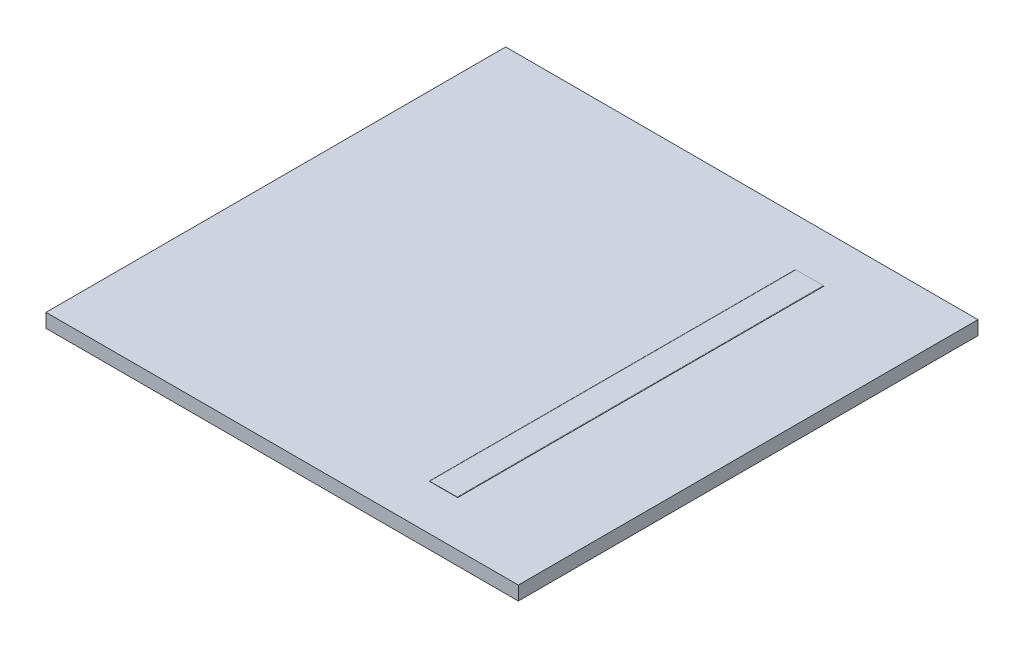
ISO-10303-21;
HEADER;
FILE_DESCRIPTION(('STEP AP214'),'2;1');
FILE_NAME('part.step','',(''),(''),'','','');
FILE_SCHEMA(('AUTOMOTIVE_DESIGN { 1 0 10303 214 1 1 1 1 }'));
ENDSEC;
DATA;
#1=APPLICATION_CONTEXT('core data for automotive mechanical design processes');
#2=APPLICATION_PROTOCOL_DEFINITION('international standard','automotive_design',2000,#1);
#3=PRODUCT_CONTEXT('',#1,'mechanical');
#4=PRODUCT('Part','Part','',(#3));
#5=PRODUCT_RELATED_PRODUCT_CATEGORY('part','',(#4));
#6=PRODUCT_DEFINITION_FORMATION('','',#4);
#7=PRODUCT_DEFINITION_CONTEXT('part definition',#1,'design');
#8=PRODUCT_DEFINITION('design','',#6,#7);
#9=PRODUCT_DEFINITION_SHAPE('','',#8);
#10=(LENGTH_UNIT() NAMED_UNIT(*) SI_UNIT(.MILLI.,.METRE.));
#11=(NAMED_UNIT(*) PLANE_ANGLE_UNIT() SI_UNIT($,.RADIAN.));
#12=(NAMED_UNIT(*) SI_UNIT($,.STERADIAN.) SOLID_ANGLE_UNIT());
#13=UNCERTAINTY_MEASURE_WITH_UNIT(LENGTH_MEASURE(1.E-05),#10,'distance_accuracy_value','');
#14=(GEOMETRIC_REPRESENTATION_CONTEXT(3) GLOBAL_UNCERTAINTY_ASSIGNED_CONTEXT((#13)) GLOBAL_UNIT_ASSIGNED_CONTEXT((#10,
#11,#12)) REPRESENTATION_CONTEXT('',''));
#15=CARTESIAN_POINT('',(0.,0.,0.));
#16=DIRECTION('',(0.,0.,1.));
#17=DIRECTION('',(1.,0.,0.));
#18=AXIS2_PLACEMENT_3D('',#15,#16,#17);
#19=CARTESIAN_POINT('',(85.5328522231227,11.1616821380238,300.));
#20=DIRECTION('',(0.,1.,0.));
#21=DIRECTION('',(-1.,0.,0.));
#22=AXIS2_PLACEMENT_3D('',#19,#20,#21);
#23=PLANE('',#22);
#24=DIRECTION('',(-1.,0.,0.));
#25=VECTOR('',#24,1.);
#26=CARTESIAN_POINT('',(108.54407460005,11.1616821380238,300.));
#27=LINE('',#26,#25);
#28=CARTESIAN_POINT('',(108.37848819904,11.1616821380238,300.));
#29=VERTEX_POINT('',#28);
#30=CARTESIAN_POINT('',(107.849337936827,11.1616821380238,300.));
#31=VERTEX_POINT('',#30);
#32=EDGE_CURVE('E62',#29,#31,#27,.T.);
#33=ORIENTED_EDGE('',*,*,#32,.T.);
#34=DIRECTION('',(1.,0.,0.));
#35=VECTOR('',#34,1.);
#36=CARTESIAN_POINT('',(85.5328522231227,11.1616821380238,300.));
#37=LINE('',#36,#35);
#38=CARTESIAN_POINT('',(85.5328522231227,11.1616821380238,300.));
#39=VERTEX_POINT('',#38);
#40=EDGE_CURVE('E175',#39,#31,#37,.T.);
#41=ORIENTED_EDGE('',*,*,#40,.F.);
#42=DIRECTION('',(-1.,0.,0.));
#43=VECTOR('',#42,1.);
#44=CARTESIAN_POINT('',(85.5328522231227,11.1616821380238,300.));
#45=LINE('',#44,#43);
#46=CARTESIAN_POINT('',(85.0037019609098,11.1616821380238,300.));
#47=VERTEX_POINT('',#46);
#48=EDGE_CURVE('E163',#39,#47,#45,.T.);
#49=ORIENTED_EDGE('',*,*,#48,.T.);
#50=DIRECTION('',(0.,0.,-1.));
#51=VECTOR('',#50,1.);
#52=CARTESIAN_POINT('',(85.0037019609098,11.1616821380238,300.));
#53=LINE('',#52,#51);
#54=CARTESIAN_POINT('',(85.0037019609098,11.1616821380238,0.));
#55=VERTEX_POINT('',#54);
#56=EDGE_CURVE('E154',#47,#55,#53,.T.);
#57=ORIENTED_EDGE('',*,*,#56,.T.);
#58=DIRECTION('',(1.,0.,0.));
#59=VECTOR('',#58,1.);
#60=CARTESIAN_POINT('',(84.8279240086719,11.1616821380238,0.));
#61=LINE('',#60,#59);
#62=CARTESIAN_POINT('',(85.5328522231227,11.1616821380238,0.));
#63=VERTEX_POINT('',#62);
#64=EDGE_CURVE('E151',#55,#63,#61,.T.);
#65=ORIENTED_EDGE('',*,*,#64,.T.);
#66=DIRECTION('',(1.,0.,0.));
#67=VECTOR('',#66,1.);
#68=CARTESIAN_POINT('',(85.5328522231227,11.1616821380238,0.));
#69=LINE('',#68,#67);
#70=CARTESIAN_POINT('',(107.849337936827,11.1616821380238,0.));
#71=VERTEX_POINT('',#70);
#72=EDGE_CURVE('E170',#63,#71,#69,.T.);
#73=ORIENTED_EDGE('',*,*,#72,.T.);
#74=DIRECTION('',(1.,0.,0.));
#75=VECTOR('',#74,1.);
#76=CARTESIAN_POINT('',(107.849337936827,11.1616821380238,0.));
#77=LINE('',#76,#75);
#78=CARTESIAN_POINT('',(108.37848819904,11.1616821380238,0.));
#79=VERTEX_POINT('',#78);
#80=EDGE_CURVE('E160',#71,#79,#77,.T.);
#81=ORIENTED_EDGE('',*,*,#80,.T.);
#82=DIRECTION('',(0.,0.,-1.));
#83=VECTOR('',#82,1.);
#84=CARTESIAN_POINT('',(108.37848819904,11.1616821380238,300.));
#85=LINE('',#84,#83);
#86=EDGE_CURVE('E157',#79,#29,#85,.F.);
#87=ORIENTED_EDGE('',*,*,#86,.T.);
#88=EDGE_LOOP('',(#33,#41,#49,#57,#65,#73,#81,#87));
#89=FACE_BOUND('',#88,.T.);
#90=DIRECTION('',(0.,0.,1.));
#91=VECTOR('',#90,1.);
#92=CARTESIAN_POINT('',(195.240578093479,11.1616821380238,-39.3837362637363));
#93=LINE('',#92,#91);
#94=CARTESIAN_POINT('',(195.240578093479,11.1616821380238,-39.3837362637363));
#95=VERTEX_POINT('',#94);
#96=CARTESIAN_POINT('',(195.240578093479,11.1616821380238,337.155692307692));
#97=VERTEX_POINT('',#96);
#98=EDGE_CURVE('E149',#95,#97,#93,.T.);
#99=ORIENTED_EDGE('',*,*,#98,.F.);
#100=DIRECTION('',(1.,0.,0.));
#101=VECTOR('',#100,1.);
#102=CARTESIAN_POINT('',(195.240578093479,11.1616821380238,-39.3837362637363));
#103=LINE('',#102,#101);
#104=CARTESIAN_POINT('',(-191.696388939488,11.1616821380238,-39.3837362637363));
#105=VERTEX_POINT('',#104);
#106=EDGE_CURVE('E138',#105,#95,#103,.T.);
#107=ORIENTED_EDGE('',*,*,#106,.F.);
#108=DIRECTION('',(0.,0.,-1.));
#109=VECTOR('',#108,1.);
#110=CARTESIAN_POINT('',(-191.696388939488,11.1616821380238,-39.3837362637363));
#111=LINE('',#110,#109);
#112=CARTESIAN_POINT('',(-191.696388939488,11.1616821380238,337.155692307692));
#113=VERTEX_POINT('',#112);
#114=EDGE_CURVE('E137',#113,#105,#111,.T.);
#115=ORIENTED_EDGE('',*,*,#114,.F.);
#116=DIRECTION('',(-1.,0.,0.));
#117=VECTOR('',#116,1.);
#118=CARTESIAN_POINT('',(195.240578093479,11.1616821380238,337.155692307692));
#119=LINE('',#118,#117);
#120=EDGE_CURVE('E123',#97,#113,#119,.T.);
#121=ORIENTED_EDGE('',*,*,#120,.F.);
#122=EDGE_LOOP('',(#99,#107,#115,#121));
#123=FACE_BOUND('',#122,.T.);
#124=ADVANCED_FACE('F39',(#89,#123),#23,.T.);
#125=CARTESIAN_POINT('',(195.240578093479,551.071079838758,337.155692307692));
#126=DIRECTION('',(0.,0.,1.));
#127=DIRECTION('',(1.,0.,0.));
#128=AXIS2_PLACEMENT_3D('',#125,#126,#127);
#129=PLANE('',#128);
#130=DIRECTION('',(-1.,0.,0.));
#131=VECTOR('',#130,1.);
#132=CARTESIAN_POINT('',(-191.696388939488,-0.2,337.155692307692));
#133=LINE('',#132,#131);
#134=CARTESIAN_POINT('',(195.240578093479,-0.199999999999999,337.155692307692));
#135=VERTEX_POINT('',#134);
#136=CARTESIAN_POINT('',(-191.696388939488,-0.2,337.155692307692));
#137=VERTEX_POINT('',#136);
#138=EDGE_CURVE('E118',#135,#137,#133,.T.);
#139=ORIENTED_EDGE('',*,*,#138,.F.);
#140=DIRECTION('',(0.,-1.,0.));
#141=VECTOR('',#140,1.);
#142=CARTESIAN_POINT('',(195.240578093479,551.071079838758,337.155692307692));
#143=LINE('',#142,#141);
#144=EDGE_CURVE('E146',#97,#135,#143,.T.);
#145=ORIENTED_EDGE('',*,*,#144,.F.);
#146=ORIENTED_EDGE('',*,*,#120,.T.);
#147=DIRECTION('',(0.,-1.,0.));
#148=VECTOR('',#147,1.);
#149=CARTESIAN_POINT('',(-191.696388939488,551.071079838758,337.155692307692));
#150=LINE('',#149,#148);
#151=EDGE_CURVE('E141',#113,#137,#150,.T.);
#152=ORIENTED_EDGE('',*,*,#151,.T.);
#153=EDGE_LOOP('',(#139,#145,#146,#152));
#154=FACE_BOUND('',#153,.T.);
#155=ADVANCED_FACE('F232',(#154),#129,.T.);
#156=CARTESIAN_POINT('',(-191.696388939488,551.071079838758,-39.3837362637363));
#157=DIRECTION('',(-1.,0.,0.));
#158=DIRECTION('',(0.,0.,1.));
#159=AXIS2_PLACEMENT_3D('',#156,#157,#158);
#160=PLANE('',#159);
#161=DIRECTION('',(0.,0.,1.));
#162=VECTOR('',#161,1.);
#163=CARTESIAN_POINT('',(-191.696388939488,-0.2,-39.3837362637363));
#164=LINE('',#163,#162);
#165=CARTESIAN_POINT('',(-191.696388939488,-0.2,-39.3837362637363));
#166=VERTEX_POINT('',#165);
#167=EDGE_CURVE('E115',#166,#137,#164,.T.);
#168=ORIENTED_EDGE('',*,*,#167,.T.);
#169=ORIENTED_EDGE('',*,*,#151,.F.);
#170=ORIENTED_EDGE('',*,*,#114,.T.);
#171=DIRECTION('',(0.,-1.,0.));
#172=VECTOR('',#171,1.);
#173=CARTESIAN_POINT('',(-191.696388939488,551.071079838758,-39.3837362637363));
#174=LINE('',#173,#172);
#175=EDGE_CURVE('E131',#105,#166,#174,.T.);
#176=ORIENTED_EDGE('',*,*,#175,.T.);
#177=EDGE_LOOP('',(#168,#169,#170,#176));
#178=FACE_BOUND('',#177,.T.);
#179=ADVANCED_FACE('F136',(#178),#160,.T.);
#180=CARTESIAN_POINT('',(195.240578093479,551.071079838758,-39.3837362637363));
#181=DIRECTION('',(0.,0.,-1.));
#182=DIRECTION('',(-1.,0.,0.));
#183=AXIS2_PLACEMENT_3D('',#180,#181,#182);
#184=PLANE('',#183);
#185=DIRECTION('',(-1.,0.,0.));
#186=VECTOR('',#185,1.);
#187=CARTESIAN_POINT('',(-191.696388939488,-0.2,-39.3837362637363));
#188=LINE('',#187,#186);
#189=CARTESIAN_POINT('',(195.240578093479,-0.199999999999978,-39.3837362637363));
#190=VERTEX_POINT('',#189);
#191=EDGE_CURVE('E54',#190,#166,#188,.T.);
#192=ORIENTED_EDGE('',*,*,#191,.T.);
#193=ORIENTED_EDGE('',*,*,#175,.F.);
#194=ORIENTED_EDGE('',*,*,#106,.T.);
#195=DIRECTION('',(0.,-1.,0.));
#196=VECTOR('',#195,1.);
#197=CARTESIAN_POINT('',(195.240578093479,551.071079838758,-39.3837362637363));
#198=LINE('',#197,#196);
#199=EDGE_CURVE('E134',#95,#190,#198,.T.);
#200=ORIENTED_EDGE('',*,*,#199,.T.);
#201=EDGE_LOOP('',(#192,#193,#194,#200));
#202=FACE_BOUND('',#201,.T.);
#203=ADVANCED_FACE('F129',(#202),#184,.T.);
#204=CARTESIAN_POINT('',(195.240578093479,551.071079838758,-39.3837362637363));
#205=DIRECTION('',(1.,0.,0.));
#206=DIRECTION('',(0.,0.,-1.));
#207=AXIS2_PLACEMENT_3D('',#204,#205,#206);
#208=PLANE('',#207);
#209=DIRECTION('',(0.,0.,1.));
#210=VECTOR('',#209,1.);
#211=CARTESIAN_POINT('',(195.240578093479,-0.199999999999999,-39.3837362637363));
#212=LINE('',#211,#210);
#213=EDGE_CURVE('E124',#190,#135,#212,.T.);
#214=ORIENTED_EDGE('',*,*,#213,.F.);
#215=ORIENTED_EDGE('',*,*,#199,.F.);
#216=ORIENTED_EDGE('',*,*,#98,.T.);
#217=ORIENTED_EDGE('',*,*,#144,.T.);
#218=EDGE_LOOP('',(#214,#215,#216,#217));
#219=FACE_BOUND('',#218,.T.);
#220=ADVANCED_FACE('F287',(#219),#208,.T.);
#221=CARTESIAN_POINT('',(85.5328522231227,11.3616821380238,300.));
#222=DIRECTION('',(0.,0.,1.));
#223=DIRECTION('',(1.,0.,0.));
#224=AXIS2_PLACEMENT_3D('',#221,#222,#223);
#225=PLANE('',#224);
#226=ORIENTED_EDGE('',*,*,#48,.F.);
#227=DIRECTION('',(0.,-1.,0.));
#228=VECTOR('',#227,1.);
#229=CARTESIAN_POINT('',(85.5328522231227,11.3616821380238,300.));
#230=LINE('',#229,#228);
#231=CARTESIAN_POINT('',(85.5328522231227,11.3616821380238,300.));
#232=VERTEX_POINT('',#231);
#233=EDGE_CURVE('E11',#232,#39,#230,.T.);
#234=ORIENTED_EDGE('',*,*,#233,.F.);
#235=CARTESIAN_POINT('',(85.5328522231227,10.5616821380238,300.));
#236=DIRECTION('',(0.,0.,-1.));
#237=DIRECTION('',(-1.,0.,0.));
#238=AXIS2_PLACEMENT_3D('',#235,#236,#237);
#239=CIRCLE('',#238,0.800000000000009);
#240=EDGE_CURVE('E173',#47,#232,#239,.T.);
#241=ORIENTED_EDGE('',*,*,#240,.F.);
#242=EDGE_LOOP('',(#226,#234,#241));
#243=FACE_BOUND('',#242,.T.);
#244=ADVANCED_FACE('F41',(#243),#225,.T.);
#245=CARTESIAN_POINT('',(85.0041560622846,10.8453727609126,300.));
#246=DIRECTION('',(0.,0.,1.));
#247=DIRECTION('',(1.,0.,0.));
#248=AXIS2_PLACEMENT_3D('',#245,#246,#247);
#249=PLANE('',#248);
#250=DIRECTION('',(1.,0.,0.));
#251=VECTOR('',#250,1.);
#252=CARTESIAN_POINT('',(85.5328522231227,11.3616821380238,300.));
#253=LINE('',#252,#251);
#254=CARTESIAN_POINT('',(107.849337936827,11.3616821380238,300.));
#255=VERTEX_POINT('',#254);
#256=EDGE_CURVE('E169',#232,#255,#253,.T.);
#257=ORIENTED_EDGE('',*,*,#256,.F.);
#258=ORIENTED_EDGE('',*,*,#233,.T.);
#259=ORIENTED_EDGE('',*,*,#40,.T.);
#260=DIRECTION('',(0.,1.,0.));
#261=VECTOR('',#260,1.);
#262=CARTESIAN_POINT('',(107.849337936827,11.1616821380238,300.));
#263=LINE('',#262,#261);
#264=EDGE_CURVE('E196',#31,#255,#263,.T.);
#265=ORIENTED_EDGE('',*,*,#264,.T.);
#266=EDGE_LOOP('',(#257,#258,#259,#265));
#267=FACE_BOUND('',#266,.T.);
#268=ADVANCED_FACE('F223',(#267),#249,.T.);
#269=CARTESIAN_POINT('',(84.8279240086719,10.9399363018755,0.));
#270=DIRECTION('',(0.,0.,-1.));
#271=DIRECTION('',(-1.,0.,0.));
#272=AXIS2_PLACEMENT_3D('',#269,#270,#271);
#273=PLANE('',#272);
#274=ORIENTED_EDGE('',*,*,#64,.F.);
#275=CARTESIAN_POINT('',(85.5328522231227,10.5616821380238,0.));
#276=DIRECTION('',(0.,0.,-1.));
#277=DIRECTION('',(-1.,0.,0.));
#278=AXIS2_PLACEMENT_3D('',#275,#276,#277);
#279=CIRCLE('',#278,0.800000000000009);
#280=CARTESIAN_POINT('',(85.5328522231227,11.3616821380238,0.));
#281=VERTEX_POINT('',#280);
#282=EDGE_CURVE('E184',#55,#281,#279,.T.);
#283=ORIENTED_EDGE('',*,*,#282,.T.);
#284=DIRECTION('',(0.,1.,0.));
#285=VECTOR('',#284,1.);
#286=CARTESIAN_POINT('',(85.5328522231227,11.1616821380238,0.));
#287=LINE('',#286,#285);
#288=EDGE_CURVE('E47',#63,#281,#287,.T.);
#289=ORIENTED_EDGE('',*,*,#288,.F.);
#290=EDGE_LOOP('',(#274,#283,#289));
#291=FACE_BOUND('',#290,.T.);
#292=ADVANCED_FACE('F220',(#291),#273,.T.);
#293=CARTESIAN_POINT('',(108.54407460005,10.9583444235673,300.));
#294=DIRECTION('',(0.,0.,1.));
#295=DIRECTION('',(1.,0.,0.));
#296=AXIS2_PLACEMENT_3D('',#293,#294,#295);
#297=PLANE('',#296);
#298=ORIENTED_EDGE('',*,*,#32,.F.);
#299=CARTESIAN_POINT('',(107.849337936827,10.5616821380238,300.));
#300=DIRECTION('',(0.,0.,-1.));
#301=DIRECTION('',(-1.,0.,0.));
#302=AXIS2_PLACEMENT_3D('',#299,#300,#301);
#303=CIRCLE('',#302,0.800000000000005);
#304=EDGE_CURVE('E167',#255,#29,#303,.T.);
#305=ORIENTED_EDGE('',*,*,#304,.F.);
#306=ORIENTED_EDGE('',*,*,#264,.F.);
#307=EDGE_LOOP('',(#298,#305,#306));
#308=FACE_BOUND('',#307,.T.);
#309=ADVANCED_FACE('F222',(#308),#297,.T.);
#310=CARTESIAN_POINT('',(107.849337936827,11.3616821380238,0.));
#311=DIRECTION('',(0.,0.,-1.));
#312=DIRECTION('',(-1.,0.,0.));
#313=AXIS2_PLACEMENT_3D('',#310,#311,#312);
#314=PLANE('',#313);
#315=ORIENTED_EDGE('',*,*,#80,.F.);
#316=DIRECTION('',(0.,-1.,0.));
#317=VECTOR('',#316,1.);
#318=CARTESIAN_POINT('',(107.849337936827,11.3616821380238,0.));
#319=LINE('',#318,#317);
#320=CARTESIAN_POINT('',(107.849337936827,11.3616821380238,0.));
#321=VERTEX_POINT('',#320);
#322=EDGE_CURVE('E193',#321,#71,#319,.T.);
#323=ORIENTED_EDGE('',*,*,#322,.F.);
#324=CARTESIAN_POINT('',(107.849337936827,10.5616821380238,0.));
#325=DIRECTION('',(0.,0.,-1.));
#326=DIRECTION('',(-1.,0.,0.));
#327=AXIS2_PLACEMENT_3D('',#324,#325,#326);
#328=CIRCLE('',#327,0.800000000000005);
#329=EDGE_CURVE('E166',#321,#79,#328,.T.);
#330=ORIENTED_EDGE('',*,*,#329,.T.);
#331=EDGE_LOOP('',(#315,#323,#330));
#332=FACE_BOUND('',#331,.T.);
#333=ADVANCED_FACE('F217',(#332),#314,.T.);
#334=CARTESIAN_POINT('',(108.370390434244,10.8591788521814,0.));
#335=DIRECTION('',(0.,0.,-1.));
#336=DIRECTION('',(-1.,0.,0.));
#337=AXIS2_PLACEMENT_3D('',#334,#335,#336);
#338=PLANE('',#337);
#339=DIRECTION('',(1.,0.,0.));
#340=VECTOR('',#339,1.);
#341=CARTESIAN_POINT('',(85.5328522231227,11.3616821380238,0.));
#342=LINE('',#341,#340);
#343=EDGE_CURVE('E181',#281,#321,#342,.T.);
#344=ORIENTED_EDGE('',*,*,#343,.T.);
#345=ORIENTED_EDGE('',*,*,#322,.T.);
#346=ORIENTED_EDGE('',*,*,#72,.F.);
#347=ORIENTED_EDGE('',*,*,#288,.T.);
#348=EDGE_LOOP('',(#344,#345,#346,#347));
#349=FACE_BOUND('',#348,.T.);
#350=ADVANCED_FACE('F200',(#349),#338,.T.);
#351=CARTESIAN_POINT('',(107.849337936827,10.5616821380238,300.));
#352=DIRECTION('',(0.,0.,-1.));
#353=DIRECTION('',(-1.,0.,0.));
#354=AXIS2_PLACEMENT_3D('',#351,#352,#353);
#355=CYLINDRICAL_SURFACE('',#354,0.800000000000005);
#356=ORIENTED_EDGE('',*,*,#86,.F.);
#357=ORIENTED_EDGE('',*,*,#329,.F.);
#358=DIRECTION('',(0.,0.,-1.));
#359=VECTOR('',#358,1.);
#360=CARTESIAN_POINT('',(107.849337936827,11.3616821380238,300.));
#361=LINE('',#360,#359);
#362=EDGE_CURVE('E190',#255,#321,#361,.T.);
#363=ORIENTED_EDGE('',*,*,#362,.F.);
#364=ORIENTED_EDGE('',*,*,#304,.T.);
#365=EDGE_LOOP('',(#356,#357,#363,#364));
#366=FACE_BOUND('',#365,.T.);
#367=ADVANCED_FACE('F215',(#366),#355,.T.);
#368=CARTESIAN_POINT('',(85.5328522231227,11.3616821380238,300.));
#369=DIRECTION('',(0.,1.,0.));
#370=DIRECTION('',(-1.,0.,0.));
#371=AXIS2_PLACEMENT_3D('',#368,#369,#370);
#372=PLANE('',#371);
#373=ORIENTED_EDGE('',*,*,#343,.F.);
#374=DIRECTION('',(0.,0.,-1.));
#375=VECTOR('',#374,1.);
#376=CARTESIAN_POINT('',(85.5328522231227,11.3616821380238,300.));
#377=LINE('',#376,#375);
#378=EDGE_CURVE('E178',#232,#281,#377,.T.);
#379=ORIENTED_EDGE('',*,*,#378,.F.);
#380=ORIENTED_EDGE('',*,*,#256,.T.);
#381=ORIENTED_EDGE('',*,*,#362,.T.);
#382=EDGE_LOOP('',(#373,#379,#380,#381));
#383=FACE_BOUND('',#382,.T.);
#384=ADVANCED_FACE('F211',(#383),#372,.T.);
#385=CARTESIAN_POINT('',(85.5328522231227,10.5616821380238,300.));
#386=DIRECTION('',(0.,0.,-1.));
#387=DIRECTION('',(-1.,0.,0.));
#388=AXIS2_PLACEMENT_3D('',#385,#386,#387);
#389=CYLINDRICAL_SURFACE('',#388,0.800000000000009);
#390=ORIENTED_EDGE('',*,*,#56,.F.);
#391=ORIENTED_EDGE('',*,*,#240,.T.);
#392=ORIENTED_EDGE('',*,*,#378,.T.);
#393=ORIENTED_EDGE('',*,*,#282,.F.);
#394=EDGE_LOOP('',(#390,#391,#392,#393));
#395=FACE_BOUND('',#394,.T.);
#396=ADVANCED_FACE('F206',(#395),#389,.T.);
#397=CARTESIAN_POINT('',(-191.696388939488,-0.2,-39.3837362637363));
#398=DIRECTION('',(0.,1.,0.));
#399=DIRECTION('',(-1.,0.,0.));
#400=AXIS2_PLACEMENT_3D('',#397,#398,#399);
#401=PLANE('',#400);
#402=ORIENTED_EDGE('',*,*,#138,.T.);
#403=ORIENTED_EDGE('',*,*,#167,.F.);
#404=ORIENTED_EDGE('',*,*,#191,.F.);
#405=ORIENTED_EDGE('',*,*,#213,.T.);
#406=EDGE_LOOP('',(#402,#403,#404,#405));
#407=FACE_BOUND('',#406,.T.);
#408=ADVANCED_FACE('F116',(#407),#401,.F.);
#409=CLOSED_SHELL('',(#124,#155,#179,#203,#220,#244,#268,#292,#309,#333,#350,#367,#384,#396,#408));
#410=MANIFOLD_SOLID_BREP('B2',#409);
#411=ADVANCED_BREP_SHAPE_REPRESENTATION('',(#18,#410),#14);
#412=SHAPE_DEFINITION_REPRESENTATION(#9,#411);
ENDSEC;
END-ISO-10303-21;
